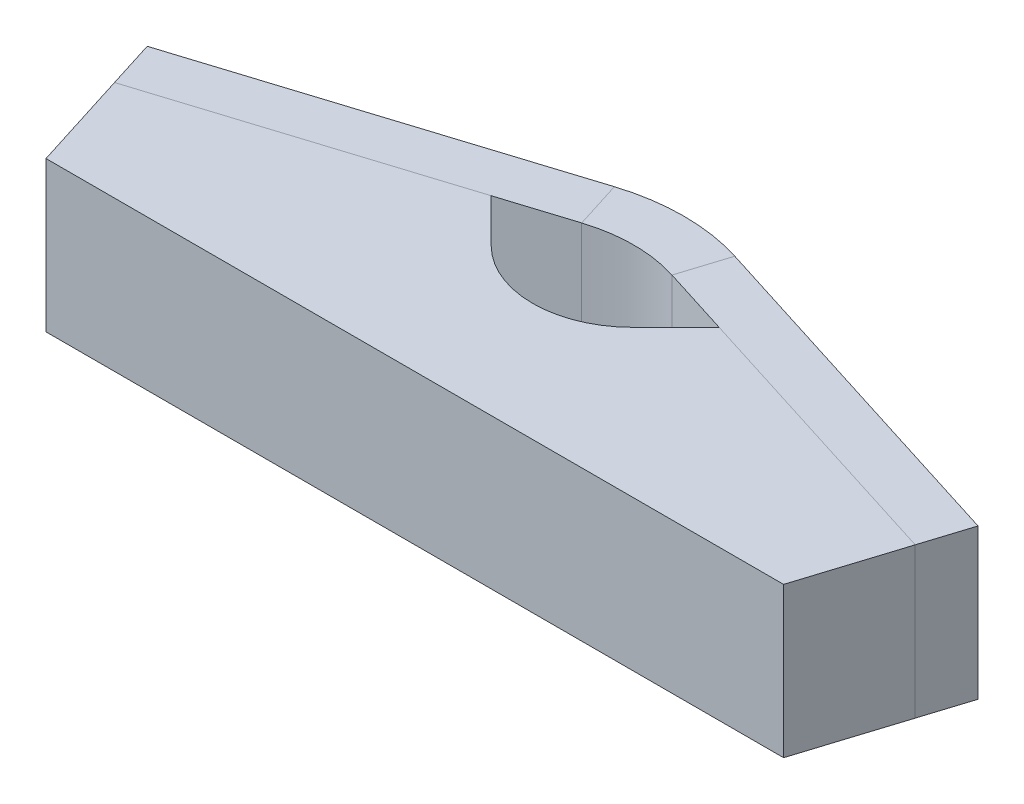
ISO-10303-21;
HEADER;
FILE_DESCRIPTION(('STEP AP214'),'2;1');
FILE_NAME('part.step','',(''),(''),'','','');
FILE_SCHEMA(('AUTOMOTIVE_DESIGN { 1 0 10303 214 1 1 1 1 }'));
ENDSEC;
DATA;
#1=APPLICATION_CONTEXT('core data for automotive mechanical design processes');
#2=APPLICATION_PROTOCOL_DEFINITION('international standard','automotive_design',2000,#1);
#3=PRODUCT_CONTEXT('',#1,'mechanical');
#4=PRODUCT('Part','Part','',(#3));
#5=PRODUCT_RELATED_PRODUCT_CATEGORY('part','',(#4));
#6=PRODUCT_DEFINITION_FORMATION('','',#4);
#7=PRODUCT_DEFINITION_CONTEXT('part definition',#1,'design');
#8=PRODUCT_DEFINITION('design','',#6,#7);
#9=PRODUCT_DEFINITION_SHAPE('','',#8);
#10=(LENGTH_UNIT() NAMED_UNIT(*) SI_UNIT(.MILLI.,.METRE.));
#11=(NAMED_UNIT(*) PLANE_ANGLE_UNIT() SI_UNIT($,.RADIAN.));
#12=(NAMED_UNIT(*) SI_UNIT($,.STERADIAN.) SOLID_ANGLE_UNIT());
#13=UNCERTAINTY_MEASURE_WITH_UNIT(LENGTH_MEASURE(1.E-05),#10,'distance_accuracy_value','');
#14=(GEOMETRIC_REPRESENTATION_CONTEXT(3) GLOBAL_UNCERTAINTY_ASSIGNED_CONTEXT((#13)) GLOBAL_UNIT_ASSIGNED_CONTEXT((#10,
#11,#12)) REPRESENTATION_CONTEXT('',''));
#15=CARTESIAN_POINT('',(0.,0.,0.));
#16=DIRECTION('',(0.,0.,1.));
#17=DIRECTION('',(1.,0.,0.));
#18=AXIS2_PLACEMENT_3D('',#15,#16,#17);
#19=CARTESIAN_POINT('',(25.4,-4.7625,8.0085892375262));
#20=DIRECTION('',(0.,1.,0.));
#21=DIRECTION('',(0.953716950748227,0.,0.300705799504274));
#22=AXIS2_PLACEMENT_3D('',#19,#20,#21);
#23=PLANE('',#22);
#24=DIRECTION('',(-0.300705799504274,0.,0.953716950748227));
#25=VECTOR('',#24,1.);
#26=CARTESIAN_POINT('',(2.8642227402782,-4.7625,0.903085961089362));
#27=LINE('',#26,#25);
#28=CARTESIAN_POINT('',(3.81896365370427,-4.7625,-2.12496535753626));
#29=VERTEX_POINT('',#28);
#30=CARTESIAN_POINT('',(2.8642227402782,-4.7625,0.903085961089362));
#31=VERTEX_POINT('',#30);
#32=EDGE_CURVE('E12',#29,#31,#27,.T.);
#33=ORIENTED_EDGE('',*,*,#32,.F.);
#34=DIRECTION('',(-0.953716950748227,0.,-0.300705799504274));
#35=VECTOR('',#34,1.);
#36=CARTESIAN_POINT('',(26.3547409134261,-4.7625,4.98053791890058));
#37=LINE('',#36,#35);
#38=CARTESIAN_POINT('',(26.3547409134261,-4.7625,4.98053791890058));
#39=VERTEX_POINT('',#38);
#40=EDGE_CURVE('E99',#29,#39,#37,.F.);
#41=ORIENTED_EDGE('',*,*,#40,.T.);
#42=DIRECTION('',(-0.300705799504274,0.,0.953716950748227));
#43=VECTOR('',#42,1.);
#44=CARTESIAN_POINT('',(25.4,-4.7625,8.0085892375262));
#45=LINE('',#44,#43);
#46=CARTESIAN_POINT('',(25.4,-4.7625,8.0085892375262));
#47=VERTEX_POINT('',#46);
#48=EDGE_CURVE('E59',#39,#47,#45,.T.);
#49=ORIENTED_EDGE('',*,*,#48,.T.);
#50=DIRECTION('',(0.953716950748227,0.,0.300705799504274));
#51=VECTOR('',#50,1.);
#52=CARTESIAN_POINT('',(25.4,-4.7625,8.0085892375262));
#53=LINE('',#52,#51);
#54=EDGE_CURVE('E102',#31,#47,#53,.T.);
#55=ORIENTED_EDGE('',*,*,#54,.F.);
#56=EDGE_LOOP('',(#33,#41,#49,#55));
#57=FACE_BOUND('',#56,.T.);
#58=ADVANCED_FACE('F49',(#57),#23,.F.);
#59=CARTESIAN_POINT('',(25.4,4.7625,8.0085892375262));
#60=DIRECTION('',(0.953716950748227,0.,0.300705799504274));
#61=DIRECTION('',(0.,-1.,0.));
#62=AXIS2_PLACEMENT_3D('',#59,#60,#61);
#63=PLANE('',#62);
#64=ORIENTED_EDGE('',*,*,#48,.F.);
#65=DIRECTION('',(0.,1.,0.));
#66=VECTOR('',#65,1.);
#67=CARTESIAN_POINT('',(26.3547409134261,4.7625,4.98053791890058));
#68=LINE('',#67,#66);
#69=CARTESIAN_POINT('',(26.3547409134261,4.7625,4.98053791890058));
#70=VERTEX_POINT('',#69);
#71=EDGE_CURVE('E127',#70,#39,#68,.F.);
#72=ORIENTED_EDGE('',*,*,#71,.F.);
#73=DIRECTION('',(-0.300705799504274,0.,0.953716950748227));
#74=VECTOR('',#73,1.);
#75=CARTESIAN_POINT('',(25.4,4.7625,8.0085892375262));
#76=LINE('',#75,#74);
#77=CARTESIAN_POINT('',(25.4,4.7625,8.0085892375262));
#78=VERTEX_POINT('',#77);
#79=EDGE_CURVE('E145',#70,#78,#76,.T.);
#80=ORIENTED_EDGE('',*,*,#79,.T.);
#81=DIRECTION('',(0.,-1.,0.));
#82=VECTOR('',#81,1.);
#83=CARTESIAN_POINT('',(25.4,4.7625,8.0085892375262));
#84=LINE('',#83,#82);
#85=EDGE_CURVE('E156',#78,#47,#84,.T.);
#86=ORIENTED_EDGE('',*,*,#85,.T.);
#87=EDGE_LOOP('',(#64,#72,#80,#86));
#88=FACE_BOUND('',#87,.T.);
#89=ADVANCED_FACE('F162',(#88),#63,.T.);
#90=CARTESIAN_POINT('',(25.4,4.7625,8.0085892375262));
#91=DIRECTION('',(0.,1.,0.));
#92=DIRECTION('',(0.953716950748227,0.,0.300705799504274));
#93=AXIS2_PLACEMENT_3D('',#90,#91,#92);
#94=PLANE('',#93);
#95=ORIENTED_EDGE('',*,*,#79,.F.);
#96=DIRECTION('',(-0.953716950748227,0.,-0.300705799504274));
#97=VECTOR('',#96,1.);
#98=CARTESIAN_POINT('',(26.3547409134261,4.7625,4.98053791890058));
#99=LINE('',#98,#97);
#100=CARTESIAN_POINT('',(3.81896365370427,4.7625,-2.12496535753626));
#101=VERTEX_POINT('',#100);
#102=EDGE_CURVE('E187',#101,#70,#99,.F.);
#103=ORIENTED_EDGE('',*,*,#102,.F.);
#104=DIRECTION('',(-0.300705799504274,0.,0.953716950748227));
#105=VECTOR('',#104,1.);
#106=CARTESIAN_POINT('',(2.8642227402782,4.7625,0.903085961089362));
#107=LINE('',#106,#105);
#108=CARTESIAN_POINT('',(2.8642227402782,4.7625,0.903085961089362));
#109=VERTEX_POINT('',#108);
#110=EDGE_CURVE('E142',#101,#109,#107,.T.);
#111=ORIENTED_EDGE('',*,*,#110,.T.);
#112=DIRECTION('',(0.953716950748227,0.,0.300705799504274));
#113=VECTOR('',#112,1.);
#114=CARTESIAN_POINT('',(25.4,4.7625,8.0085892375262));
#115=LINE('',#114,#113);
#116=EDGE_CURVE('E163',#109,#78,#115,.T.);
#117=ORIENTED_EDGE('',*,*,#116,.T.);
#118=EDGE_LOOP('',(#95,#103,#111,#117));
#119=FACE_BOUND('',#118,.T.);
#120=ADVANCED_FACE('F193',(#119),#94,.T.);
#121=CARTESIAN_POINT('',(0.,4.7625,9.98723991696622));
#122=DIRECTION('',(0.,1.,0.));
#123=DIRECTION('',(0.,0.,1.));
#124=AXIS2_PLACEMENT_3D('',#121,#122,#123);
#125=PLANE('',#124);
#126=ORIENTED_EDGE('',*,*,#110,.F.);
#127=CARTESIAN_POINT('',(0.,4.7625,9.98723991696622));
#128=DIRECTION('',(0.,1.,0.));
#129=DIRECTION('',(0.,0.,1.));
#130=AXIS2_PLACEMENT_3D('',#127,#128,#129);
#131=CIRCLE('',#130,12.7);
#132=CARTESIAN_POINT('',(-3.81896365370428,4.7625,-2.12496535753626));
#133=VERTEX_POINT('',#132);
#134=EDGE_CURVE('E117',#101,#133,#131,.T.);
#135=ORIENTED_EDGE('',*,*,#134,.T.);
#136=DIRECTION('',(0.300705799504274,0.,0.953716950748227));
#137=VECTOR('',#136,1.);
#138=CARTESIAN_POINT('',(-2.86422274027821,4.7625,0.903085961089365));
#139=LINE('',#138,#137);
#140=CARTESIAN_POINT('',(-2.86422274027821,4.7625,0.903085961089365));
#141=VERTEX_POINT('',#140);
#142=EDGE_CURVE('E67',#133,#141,#139,.T.);
#143=ORIENTED_EDGE('',*,*,#142,.T.);
#144=CARTESIAN_POINT('',(0.,4.7625,9.98723991696622));
#145=DIRECTION('',(0.,-1.,0.));
#146=DIRECTION('',(0.,0.,-1.));
#147=AXIS2_PLACEMENT_3D('',#144,#145,#146);
#148=CIRCLE('',#147,9.525);
#149=EDGE_CURVE('E160',#109,#141,#148,.F.);
#150=ORIENTED_EDGE('',*,*,#149,.F.);
#151=EDGE_LOOP('',(#126,#135,#143,#150));
#152=FACE_BOUND('',#151,.T.);
#153=ADVANCED_FACE('F196',(#152),#125,.T.);
#154=CARTESIAN_POINT('',(0.,4.7625,0.));
#155=DIRECTION('',(0.,1.,0.));
#156=DIRECTION('',(0.953716950748227,0.,-0.300705799504274));
#157=AXIS2_PLACEMENT_3D('',#154,#155,#156);
#158=PLANE('',#157);
#159=ORIENTED_EDGE('',*,*,#142,.F.);
#160=DIRECTION('',(-0.953716950748227,0.,0.300705799504274));
#161=VECTOR('',#160,1.);
#162=CARTESIAN_POINT('',(-0.954740913426069,4.7625,-3.02805131862562));
#163=LINE('',#162,#161);
#164=CARTESIAN_POINT('',(-26.3547409134261,4.7625,4.98053791890058));
#165=VERTEX_POINT('',#164);
#166=EDGE_CURVE('E186',#165,#133,#163,.F.);
#167=ORIENTED_EDGE('',*,*,#166,.F.);
#168=DIRECTION('',(0.300705799504274,0.,0.953716950748227));
#169=VECTOR('',#168,1.);
#170=CARTESIAN_POINT('',(-25.4,4.7625,8.0085892375262));
#171=LINE('',#170,#169);
#172=CARTESIAN_POINT('',(-25.4,4.7625,8.0085892375262));
#173=VERTEX_POINT('',#172);
#174=EDGE_CURVE('E138',#165,#173,#171,.T.);
#175=ORIENTED_EDGE('',*,*,#174,.T.);
#176=DIRECTION('',(0.953716950748227,0.,-0.300705799504274));
#177=VECTOR('',#176,1.);
#178=CARTESIAN_POINT('',(0.,4.7625,0.));
#179=LINE('',#178,#177);
#180=EDGE_CURVE('E170',#173,#141,#179,.T.);
#181=ORIENTED_EDGE('',*,*,#180,.T.);
#182=EDGE_LOOP('',(#159,#167,#175,#181));
#183=FACE_BOUND('',#182,.T.);
#184=ADVANCED_FACE('F207',(#183),#158,.T.);
#185=CARTESIAN_POINT('',(-25.4,4.7625,8.0085892375262));
#186=DIRECTION('',(0.953716950748227,0.,-0.300705799504274));
#187=DIRECTION('',(0.,-1.,0.));
#188=AXIS2_PLACEMENT_3D('',#185,#186,#187);
#189=PLANE('',#188);
#190=ORIENTED_EDGE('',*,*,#174,.F.);
#191=DIRECTION('',(0.,1.,0.));
#192=VECTOR('',#191,1.);
#193=CARTESIAN_POINT('',(-26.3547409134261,4.7625,4.98053791890058));
#194=LINE('',#193,#192);
#195=CARTESIAN_POINT('',(-26.3547409134261,-4.7625,4.98053791890058));
#196=VERTEX_POINT('',#195);
#197=EDGE_CURVE('E122',#165,#196,#194,.F.);
#198=ORIENTED_EDGE('',*,*,#197,.T.);
#199=DIRECTION('',(0.300705799504274,0.,0.953716950748227));
#200=VECTOR('',#199,1.);
#201=CARTESIAN_POINT('',(-25.4,-4.7625,8.0085892375262));
#202=LINE('',#201,#200);
#203=CARTESIAN_POINT('',(-25.4,-4.7625,8.0085892375262));
#204=VERTEX_POINT('',#203);
#205=EDGE_CURVE('E135',#196,#204,#202,.T.);
#206=ORIENTED_EDGE('',*,*,#205,.T.);
#207=DIRECTION('',(0.,-1.,0.));
#208=VECTOR('',#207,1.);
#209=CARTESIAN_POINT('',(-25.4,4.7625,8.0085892375262));
#210=LINE('',#209,#208);
#211=EDGE_CURVE('E173',#173,#204,#210,.T.);
#212=ORIENTED_EDGE('',*,*,#211,.F.);
#213=EDGE_LOOP('',(#190,#198,#206,#212));
#214=FACE_BOUND('',#213,.T.);
#215=ADVANCED_FACE('F213',(#214),#189,.F.);
#216=CARTESIAN_POINT('',(0.,-4.7625,0.));
#217=DIRECTION('',(0.,1.,0.));
#218=DIRECTION('',(0.953716950748227,0.,-0.300705799504274));
#219=AXIS2_PLACEMENT_3D('',#216,#217,#218);
#220=PLANE('',#219);
#221=ORIENTED_EDGE('',*,*,#205,.F.);
#222=DIRECTION('',(-0.953716950748227,0.,0.300705799504274));
#223=VECTOR('',#222,1.);
#224=CARTESIAN_POINT('',(-0.954740913426069,-4.7625,-3.02805131862562));
#225=LINE('',#224,#223);
#226=CARTESIAN_POINT('',(-3.81896365370428,-4.7625,-2.12496535753625));
#227=VERTEX_POINT('',#226);
#228=EDGE_CURVE('E184',#196,#227,#225,.F.);
#229=ORIENTED_EDGE('',*,*,#228,.T.);
#230=DIRECTION('',(0.300705799504274,0.,0.953716950748227));
#231=VECTOR('',#230,1.);
#232=CARTESIAN_POINT('',(-2.86422274027821,-4.7625,0.903085961089365));
#233=LINE('',#232,#231);
#234=CARTESIAN_POINT('',(-2.86422274027821,-4.7625,0.903085961089365));
#235=VERTEX_POINT('',#234);
#236=EDGE_CURVE('E53',#227,#235,#233,.T.);
#237=ORIENTED_EDGE('',*,*,#236,.T.);
#238=DIRECTION('',(0.953716950748227,0.,-0.300705799504274));
#239=VECTOR('',#238,1.);
#240=CARTESIAN_POINT('',(0.,-4.7625,0.));
#241=LINE('',#240,#239);
#242=EDGE_CURVE('E165',#204,#235,#241,.T.);
#243=ORIENTED_EDGE('',*,*,#242,.F.);
#244=EDGE_LOOP('',(#221,#229,#237,#243));
#245=FACE_BOUND('',#244,.T.);
#246=ADVANCED_FACE('F217',(#245),#220,.F.);
#247=CARTESIAN_POINT('',(0.,-4.7625,9.98723991696622));
#248=DIRECTION('',(0.,-1.,0.));
#249=DIRECTION('',(0.,0.,-1.));
#250=AXIS2_PLACEMENT_3D('',#247,#248,#249);
#251=PLANE('',#250);
#252=CARTESIAN_POINT('',(0.,-4.7625,9.98723991696622));
#253=DIRECTION('',(0.,1.,0.));
#254=DIRECTION('',(0.,0.,1.));
#255=AXIS2_PLACEMENT_3D('',#252,#253,#254);
#256=CIRCLE('',#255,12.7);
#257=EDGE_CURVE('E115',#227,#29,#256,.F.);
#258=ORIENTED_EDGE('',*,*,#257,.T.);
#259=ORIENTED_EDGE('',*,*,#32,.T.);
#260=CARTESIAN_POINT('',(0.,-4.7625,9.98723991696622));
#261=DIRECTION('',(0.,1.,0.));
#262=DIRECTION('',(0.,0.,1.));
#263=AXIS2_PLACEMENT_3D('',#260,#261,#262);
#264=CIRCLE('',#263,9.525);
#265=EDGE_CURVE('E180',#235,#31,#264,.F.);
#266=ORIENTED_EDGE('',*,*,#265,.F.);
#267=ORIENTED_EDGE('',*,*,#236,.F.);
#268=EDGE_LOOP('',(#258,#259,#266,#267));
#269=FACE_BOUND('',#268,.T.);
#270=ADVANCED_FACE('F51',(#269),#251,.T.);
#271=CARTESIAN_POINT('',(0.,4.7625,0.));
#272=DIRECTION('',(-0.300705799504274,0.,-0.953716950748227));
#273=DIRECTION('',(-0.953716950748227,0.,0.300705799504274));
#274=AXIS2_PLACEMENT_3D('',#271,#272,#273);
#275=PLANE('',#274);
#276=ORIENTED_EDGE('',*,*,#242,.T.);
#277=DIRECTION('',(0.,-1.,0.));
#278=VECTOR('',#277,1.);
#279=CARTESIAN_POINT('',(-2.86422274027821,4.7625,0.903085961089367));
#280=LINE('',#279,#278);
#281=EDGE_CURVE('E177',#235,#141,#280,.F.);
#282=ORIENTED_EDGE('',*,*,#281,.T.);
#283=ORIENTED_EDGE('',*,*,#180,.F.);
#284=ORIENTED_EDGE('',*,*,#211,.T.);
#285=EDGE_LOOP('',(#276,#282,#283,#284));
#286=FACE_BOUND('',#285,.T.);
#287=ADVANCED_FACE('F212',(#286),#275,.F.);
#288=CARTESIAN_POINT('',(25.4,4.7625,8.0085892375262));
#289=DIRECTION('',(0.300705799504274,0.,-0.953716950748227));
#290=DIRECTION('',(-0.953716950748227,0.,-0.300705799504274));
#291=AXIS2_PLACEMENT_3D('',#288,#289,#290);
#292=PLANE('',#291);
#293=ORIENTED_EDGE('',*,*,#116,.F.);
#294=DIRECTION('',(0.,-1.,0.));
#295=VECTOR('',#294,1.);
#296=CARTESIAN_POINT('',(2.8642227402782,-4.7625,0.903085961089364));
#297=LINE('',#296,#295);
#298=EDGE_CURVE('E159',#109,#31,#297,.T.);
#299=ORIENTED_EDGE('',*,*,#298,.T.);
#300=ORIENTED_EDGE('',*,*,#54,.T.);
#301=ORIENTED_EDGE('',*,*,#85,.F.);
#302=EDGE_LOOP('',(#293,#299,#300,#301));
#303=FACE_BOUND('',#302,.T.);
#304=ADVANCED_FACE('F155',(#303),#292,.F.);
#305=CARTESIAN_POINT('',(0.,4.7625,9.98723991696622));
#306=DIRECTION('',(0.,1.,0.));
#307=DIRECTION('',(0.,0.,1.));
#308=AXIS2_PLACEMENT_3D('',#305,#306,#307);
#309=CYLINDRICAL_SURFACE('',#308,9.525);
#310=ORIENTED_EDGE('',*,*,#149,.T.);
#311=ORIENTED_EDGE('',*,*,#281,.F.);
#312=ORIENTED_EDGE('',*,*,#265,.T.);
#313=ORIENTED_EDGE('',*,*,#298,.F.);
#314=EDGE_LOOP('',(#310,#311,#312,#313));
#315=FACE_BOUND('',#314,.T.);
#316=ADVANCED_FACE('F199',(#315),#309,.F.);
#317=CARTESIAN_POINT('',(-0.954740913426069,4.7625,-3.02805131862562));
#318=DIRECTION('',(-0.300705799504274,0.,-0.953716950748227));
#319=DIRECTION('',(-0.953716950748227,0.,0.300705799504274));
#320=AXIS2_PLACEMENT_3D('',#317,#318,#319);
#321=PLANE('',#320);
#322=ORIENTED_EDGE('',*,*,#228,.F.);
#323=ORIENTED_EDGE('',*,*,#197,.F.);
#324=ORIENTED_EDGE('',*,*,#166,.T.);
#325=DIRECTION('',(0.,1.,0.));
#326=VECTOR('',#325,1.);
#327=CARTESIAN_POINT('',(-3.81896365370428,4.7625,-2.12496535753625));
#328=LINE('',#327,#326);
#329=EDGE_CURVE('E121',#227,#133,#328,.T.);
#330=ORIENTED_EDGE('',*,*,#329,.F.);
#331=EDGE_LOOP('',(#322,#323,#324,#330));
#332=FACE_BOUND('',#331,.T.);
#333=ADVANCED_FACE('F219',(#332),#321,.T.);
#334=CARTESIAN_POINT('',(26.3547409134261,4.7625,4.98053791890058));
#335=DIRECTION('',(0.300705799504274,0.,-0.953716950748227));
#336=DIRECTION('',(-0.953716950748227,0.,-0.300705799504274));
#337=AXIS2_PLACEMENT_3D('',#334,#335,#336);
#338=PLANE('',#337);
#339=ORIENTED_EDGE('',*,*,#102,.T.);
#340=ORIENTED_EDGE('',*,*,#71,.T.);
#341=ORIENTED_EDGE('',*,*,#40,.F.);
#342=DIRECTION('',(0.,1.,0.));
#343=VECTOR('',#342,1.);
#344=CARTESIAN_POINT('',(3.81896365370427,4.7625,-2.12496535753626));
#345=LINE('',#344,#343);
#346=EDGE_CURVE('E112',#101,#29,#345,.F.);
#347=ORIENTED_EDGE('',*,*,#346,.F.);
#348=EDGE_LOOP('',(#339,#340,#341,#347));
#349=FACE_BOUND('',#348,.T.);
#350=ADVANCED_FACE('F125',(#349),#338,.T.);
#351=CARTESIAN_POINT('',(0.,4.7625,9.98723991696622));
#352=DIRECTION('',(0.,1.,0.));
#353=DIRECTION('',(0.,0.,1.));
#354=AXIS2_PLACEMENT_3D('',#351,#352,#353);
#355=CYLINDRICAL_SURFACE('',#354,12.7);
#356=ORIENTED_EDGE('',*,*,#134,.F.);
#357=ORIENTED_EDGE('',*,*,#346,.T.);
#358=ORIENTED_EDGE('',*,*,#257,.F.);
#359=ORIENTED_EDGE('',*,*,#329,.T.);
#360=EDGE_LOOP('',(#356,#357,#358,#359));
#361=FACE_BOUND('',#360,.T.);
#362=ADVANCED_FACE('F113',(#361),#355,.T.);
#363=CLOSED_SHELL('',(#58,#89,#120,#153,#184,#215,#246,#270,#287,#304,#316,#333,#350,#362));
#364=MANIFOLD_SOLID_BREP('B2',#363);
#365=CARTESIAN_POINT('',(0.,-4.7625,0.));
#366=DIRECTION('',(0.,-1.,0.));
#367=DIRECTION('',(0.,0.,-1.));
#368=AXIS2_PLACEMENT_3D('',#365,#366,#367);
#369=PLANE('',#368);
#370=DIRECTION('',(0.300705799504274,0.,0.953716950748227));
#371=VECTOR('',#370,1.);
#372=CARTESIAN_POINT('',(-23.3978526906184,-4.7625,14.3585892375262));
#373=LINE('',#372,#371);
#374=CARTESIAN_POINT('',(-25.4,-4.7625,8.0085892375262));
#375=VERTEX_POINT('',#374);
#376=CARTESIAN_POINT('',(-23.3978526906184,-4.7625,14.3585892375262));
#377=VERTEX_POINT('',#376);
#378=EDGE_CURVE('E487',#375,#377,#373,.T.);
#379=ORIENTED_EDGE('',*,*,#378,.F.);
#380=DIRECTION('',(-0.953716950748227,0.,0.300705799504274));
#381=VECTOR('',#380,1.);
#382=CARTESIAN_POINT('',(-25.4,-4.7625,8.0085892375262));
#383=LINE('',#382,#381);
#384=CARTESIAN_POINT('',(-7.23169208824628,-4.7625,2.28014375696978));
#385=VERTEX_POINT('',#384);
#386=EDGE_CURVE('E490',#385,#375,#383,.T.);
#387=ORIENTED_EDGE('',*,*,#386,.F.);
#388=DIRECTION('',(-0.707106781186548,0.,-0.707106781186548));
#389=VECTOR('',#388,1.);
#390=CARTESIAN_POINT('',(-7.23169208824628,-4.7625,2.28014375696978));
#391=LINE('',#390,#389);
#392=CARTESIAN_POINT('',(-4.49012806053458,-4.7625,5.02170778468149));
#393=VERTEX_POINT('',#392);
#394=EDGE_CURVE('E494',#393,#385,#391,.T.);
#395=ORIENTED_EDGE('',*,*,#394,.F.);
#396=CARTESIAN_POINT('',(0.,-4.7625,0.531579724146914));
#397=DIRECTION('',(0.,-1.,0.));
#398=DIRECTION('',(0.,0.,-1.));
#399=AXIS2_PLACEMENT_3D('',#396,#397,#398);
#400=CIRCLE('',#399,6.35);
#401=CARTESIAN_POINT('',(4.49012806053458,-4.7625,5.02170778468149));
#402=VERTEX_POINT('',#401);
#403=EDGE_CURVE('E47',#393,#402,#400,.F.);
#404=ORIENTED_EDGE('',*,*,#403,.T.);
#405=DIRECTION('',(-0.707106781186548,0.,0.707106781186547));
#406=VECTOR('',#405,1.);
#407=CARTESIAN_POINT('',(0.,-4.7625,9.51183584521607));
#408=LINE('',#407,#406);
#409=CARTESIAN_POINT('',(7.23169208824628,-4.7625,2.28014375696979));
#410=VERTEX_POINT('',#409);
#411=EDGE_CURVE('E496',#410,#402,#408,.T.);
#412=ORIENTED_EDGE('',*,*,#411,.F.);
#413=DIRECTION('',(-0.953716950748227,0.,-0.300705799504274));
#414=VECTOR('',#413,1.);
#415=CARTESIAN_POINT('',(7.23169208824628,-4.7625,2.28014375696979));
#416=LINE('',#415,#414);
#417=CARTESIAN_POINT('',(25.4,-4.7625,8.0085892375262));
#418=VERTEX_POINT('',#417);
#419=EDGE_CURVE('E461',#418,#410,#416,.T.);
#420=ORIENTED_EDGE('',*,*,#419,.F.);
#421=DIRECTION('',(0.300705799504274,0.,-0.953716950748227));
#422=VECTOR('',#421,1.);
#423=CARTESIAN_POINT('',(25.4,-4.7625,8.0085892375262));
#424=LINE('',#423,#422);
#425=CARTESIAN_POINT('',(23.3978526906184,-4.7625,14.3585892375262));
#426=VERTEX_POINT('',#425);
#427=EDGE_CURVE('E455',#426,#418,#424,.T.);
#428=ORIENTED_EDGE('',*,*,#427,.F.);
#429=DIRECTION('',(1.,0.,0.));
#430=VECTOR('',#429,1.);
#431=CARTESIAN_POINT('',(23.3978526906184,-4.7625,14.3585892375262));
#432=LINE('',#431,#430);
#433=EDGE_CURVE('E458',#377,#426,#432,.T.);
#434=ORIENTED_EDGE('',*,*,#433,.F.);
#435=EDGE_LOOP('',(#379,#387,#395,#404,#412,#420,#428,#434));
#436=FACE_BOUND('',#435,.T.);
#437=ADVANCED_FACE('F393',(#436),#369,.T.);
#438=CARTESIAN_POINT('',(0.,4.7625,0.));
#439=DIRECTION('',(0.,-1.,0.));
#440=DIRECTION('',(0.,0.,-1.));
#441=AXIS2_PLACEMENT_3D('',#438,#439,#440);
#442=PLANE('',#441);
#443=DIRECTION('',(0.300705799504274,0.,0.953716950748227));
#444=VECTOR('',#443,1.);
#445=CARTESIAN_POINT('',(-23.3978526906184,4.7625,14.3585892375262));
#446=LINE('',#445,#444);
#447=CARTESIAN_POINT('',(-25.4,4.7625,8.0085892375262));
#448=VERTEX_POINT('',#447);
#449=CARTESIAN_POINT('',(-23.3978526906184,4.7625,14.3585892375262));
#450=VERTEX_POINT('',#449);
#451=EDGE_CURVE('E485',#448,#450,#446,.T.);
#452=ORIENTED_EDGE('',*,*,#451,.T.);
#453=DIRECTION('',(1.,0.,0.));
#454=VECTOR('',#453,1.);
#455=CARTESIAN_POINT('',(23.3978526906184,4.7625,14.3585892375262));
#456=LINE('',#455,#454);
#457=CARTESIAN_POINT('',(23.3978526906184,4.7625,14.3585892375262));
#458=VERTEX_POINT('',#457);
#459=EDGE_CURVE('E527',#450,#458,#456,.T.);
#460=ORIENTED_EDGE('',*,*,#459,.T.);
#461=DIRECTION('',(0.300705799504274,0.,-0.953716950748227));
#462=VECTOR('',#461,1.);
#463=CARTESIAN_POINT('',(25.4,4.7625,8.0085892375262));
#464=LINE('',#463,#462);
#465=CARTESIAN_POINT('',(25.4,4.7625,8.0085892375262));
#466=VERTEX_POINT('',#465);
#467=EDGE_CURVE('E470',#458,#466,#464,.T.);
#468=ORIENTED_EDGE('',*,*,#467,.T.);
#469=DIRECTION('',(-0.953716950748227,0.,-0.300705799504274));
#470=VECTOR('',#469,1.);
#471=CARTESIAN_POINT('',(7.23169208824628,4.7625,2.28014375696979));
#472=LINE('',#471,#470);
#473=CARTESIAN_POINT('',(7.23169208824628,4.7625,2.28014375696979));
#474=VERTEX_POINT('',#473);
#475=EDGE_CURVE('E522',#466,#474,#472,.T.);
#476=ORIENTED_EDGE('',*,*,#475,.T.);
#477=DIRECTION('',(-0.707106781186548,0.,0.707106781186547));
#478=VECTOR('',#477,1.);
#479=CARTESIAN_POINT('',(0.,4.7625,9.51183584521607));
#480=LINE('',#479,#478);
#481=CARTESIAN_POINT('',(4.49012806053458,4.7625,5.02170778468149));
#482=VERTEX_POINT('',#481);
#483=EDGE_CURVE('E515',#474,#482,#480,.T.);
#484=ORIENTED_EDGE('',*,*,#483,.T.);
#485=CARTESIAN_POINT('',(0.,4.7625,0.531579724146914));
#486=DIRECTION('',(0.,-1.,0.));
#487=DIRECTION('',(0.,0.,-1.));
#488=AXIS2_PLACEMENT_3D('',#485,#486,#487);
#489=CIRCLE('',#488,6.35);
#490=CARTESIAN_POINT('',(-4.49012806053458,4.7625,5.02170778468149));
#491=VERTEX_POINT('',#490);
#492=EDGE_CURVE('E401',#482,#491,#489,.T.);
#493=ORIENTED_EDGE('',*,*,#492,.T.);
#494=DIRECTION('',(-0.707106781186548,0.,-0.707106781186548));
#495=VECTOR('',#494,1.);
#496=CARTESIAN_POINT('',(-7.23169208824628,4.7625,2.28014375696978));
#497=LINE('',#496,#495);
#498=CARTESIAN_POINT('',(-7.23169208824628,4.7625,2.28014375696978));
#499=VERTEX_POINT('',#498);
#500=EDGE_CURVE('E481',#491,#499,#497,.T.);
#501=ORIENTED_EDGE('',*,*,#500,.T.);
#502=DIRECTION('',(-0.953716950748227,0.,0.300705799504274));
#503=VECTOR('',#502,1.);
#504=CARTESIAN_POINT('',(-25.4,4.7625,8.0085892375262));
#505=LINE('',#504,#503);
#506=EDGE_CURVE('E478',#499,#448,#505,.T.);
#507=ORIENTED_EDGE('',*,*,#506,.T.);
#508=EDGE_LOOP('',(#452,#460,#468,#476,#484,#493,#501,#507));
#509=FACE_BOUND('',#508,.T.);
#510=ADVANCED_FACE('F520',(#509),#442,.F.);
#511=CARTESIAN_POINT('',(23.3978526906184,-56.9786741726333,14.3585892375262));
#512=DIRECTION('',(0.,0.,1.));
#513=DIRECTION('',(1.,0.,0.));
#514=AXIS2_PLACEMENT_3D('',#511,#512,#513);
#515=PLANE('',#514);
#516=DIRECTION('',(0.,1.,0.));
#517=VECTOR('',#516,1.);
#518=CARTESIAN_POINT('',(-23.3978526906184,-56.9786741726333,14.3585892375262));
#519=LINE('',#518,#517);
#520=EDGE_CURVE('E477',#377,#450,#519,.T.);
#521=ORIENTED_EDGE('',*,*,#520,.F.);
#522=ORIENTED_EDGE('',*,*,#433,.T.);
#523=DIRECTION('',(0.,1.,0.));
#524=VECTOR('',#523,1.);
#525=CARTESIAN_POINT('',(23.3978526906184,-56.9786741726333,14.3585892375262));
#526=LINE('',#525,#524);
#527=EDGE_CURVE('E465',#426,#458,#526,.T.);
#528=ORIENTED_EDGE('',*,*,#527,.T.);
#529=ORIENTED_EDGE('',*,*,#459,.F.);
#530=EDGE_LOOP('',(#521,#522,#528,#529));
#531=FACE_BOUND('',#530,.T.);
#532=ADVANCED_FACE('F476',(#531),#515,.T.);
#533=CARTESIAN_POINT('',(25.4,-56.9786741726333,8.0085892375262));
#534=DIRECTION('',(0.953716950748227,0.,0.300705799504274));
#535=DIRECTION('',(0.300705799504274,0.,-0.953716950748227));
#536=AXIS2_PLACEMENT_3D('',#533,#534,#535);
#537=PLANE('',#536);
#538=ORIENTED_EDGE('',*,*,#527,.F.);
#539=ORIENTED_EDGE('',*,*,#427,.T.);
#540=DIRECTION('',(0.,1.,0.));
#541=VECTOR('',#540,1.);
#542=CARTESIAN_POINT('',(25.4,-56.9786741726333,8.0085892375262));
#543=LINE('',#542,#541);
#544=EDGE_CURVE('E464',#418,#466,#543,.T.);
#545=ORIENTED_EDGE('',*,*,#544,.T.);
#546=ORIENTED_EDGE('',*,*,#467,.F.);
#547=EDGE_LOOP('',(#538,#539,#545,#546));
#548=FACE_BOUND('',#547,.T.);
#549=ADVANCED_FACE('F468',(#548),#537,.T.);
#550=CARTESIAN_POINT('',(7.23169208824628,-56.9786741726333,2.28014375696979));
#551=DIRECTION('',(0.300705799504274,0.,-0.953716950748227));
#552=DIRECTION('',(-0.953716950748227,0.,-0.300705799504274));
#553=AXIS2_PLACEMENT_3D('',#550,#551,#552);
#554=PLANE('',#553);
#555=ORIENTED_EDGE('',*,*,#544,.F.);
#556=ORIENTED_EDGE('',*,*,#419,.T.);
#557=DIRECTION('',(0.,1.,0.));
#558=VECTOR('',#557,1.);
#559=CARTESIAN_POINT('',(7.23169208824628,-56.9786741726333,2.28014375696979));
#560=LINE('',#559,#558);
#561=EDGE_CURVE('E499',#410,#474,#560,.T.);
#562=ORIENTED_EDGE('',*,*,#561,.T.);
#563=ORIENTED_EDGE('',*,*,#475,.F.);
#564=EDGE_LOOP('',(#555,#556,#562,#563));
#565=FACE_BOUND('',#564,.T.);
#566=ADVANCED_FACE('F539',(#565),#554,.T.);
#567=CARTESIAN_POINT('',(0.,-56.9786741726333,9.51183584521607));
#568=DIRECTION('',(-0.707106781186547,0.,-0.707106781186548));
#569=DIRECTION('',(-0.707106781186548,0.,0.707106781186547));
#570=AXIS2_PLACEMENT_3D('',#567,#568,#569);
#571=PLANE('',#570);
#572=ORIENTED_EDGE('',*,*,#411,.T.);
#573=DIRECTION('',(0.,1.,0.));
#574=VECTOR('',#573,1.);
#575=CARTESIAN_POINT('',(4.49012806053458,4.7625,5.02170778468149));
#576=LINE('',#575,#574);
#577=EDGE_CURVE('E507',#402,#482,#576,.T.);
#578=ORIENTED_EDGE('',*,*,#577,.T.);
#579=ORIENTED_EDGE('',*,*,#483,.F.);
#580=ORIENTED_EDGE('',*,*,#561,.F.);
#581=EDGE_LOOP('',(#572,#578,#579,#580));
#582=FACE_BOUND('',#581,.T.);
#583=ADVANCED_FACE('F513',(#582),#571,.T.);
#584=CARTESIAN_POINT('',(-7.23169208824628,-56.9786741726333,2.28014375696978));
#585=DIRECTION('',(0.707106781186547,0.,-0.707106781186547));
#586=DIRECTION('',(-0.707106781186548,0.,-0.707106781186548));
#587=AXIS2_PLACEMENT_3D('',#584,#585,#586);
#588=PLANE('',#587);
#589=ORIENTED_EDGE('',*,*,#500,.F.);
#590=DIRECTION('',(0.,1.,0.));
#591=VECTOR('',#590,1.);
#592=CARTESIAN_POINT('',(-4.49012806053458,-4.7625,5.02170778468149));
#593=LINE('',#592,#591);
#594=EDGE_CURVE('E414',#491,#393,#593,.F.);
#595=ORIENTED_EDGE('',*,*,#594,.T.);
#596=ORIENTED_EDGE('',*,*,#394,.T.);
#597=DIRECTION('',(0.,1.,0.));
#598=VECTOR('',#597,1.);
#599=CARTESIAN_POINT('',(-7.23169208824628,-56.9786741726333,2.28014375696978));
#600=LINE('',#599,#598);
#601=EDGE_CURVE('E493',#385,#499,#600,.T.);
#602=ORIENTED_EDGE('',*,*,#601,.T.);
#603=EDGE_LOOP('',(#589,#595,#596,#602));
#604=FACE_BOUND('',#603,.T.);
#605=ADVANCED_FACE('F537',(#604),#588,.T.);
#606=CARTESIAN_POINT('',(-25.4,-56.9786741726333,8.0085892375262));
#607=DIRECTION('',(-0.300705799504274,0.,-0.953716950748227));
#608=DIRECTION('',(-0.953716950748227,0.,0.300705799504274));
#609=AXIS2_PLACEMENT_3D('',#606,#607,#608);
#610=PLANE('',#609);
#611=ORIENTED_EDGE('',*,*,#601,.F.);
#612=ORIENTED_EDGE('',*,*,#386,.T.);
#613=DIRECTION('',(0.,1.,0.));
#614=VECTOR('',#613,1.);
#615=CARTESIAN_POINT('',(-25.4,-56.9786741726333,8.0085892375262));
#616=LINE('',#615,#614);
#617=EDGE_CURVE('E489',#375,#448,#616,.T.);
#618=ORIENTED_EDGE('',*,*,#617,.T.);
#619=ORIENTED_EDGE('',*,*,#506,.F.);
#620=EDGE_LOOP('',(#611,#612,#618,#619));
#621=FACE_BOUND('',#620,.T.);
#622=ADVANCED_FACE('F536',(#621),#610,.T.);
#623=CARTESIAN_POINT('',(-23.3978526906184,-56.9786741726333,14.3585892375262));
#624=DIRECTION('',(-0.953716950748227,0.,0.300705799504274));
#625=DIRECTION('',(0.300705799504274,0.,0.953716950748227));
#626=AXIS2_PLACEMENT_3D('',#623,#624,#625);
#627=PLANE('',#626);
#628=ORIENTED_EDGE('',*,*,#617,.F.);
#629=ORIENTED_EDGE('',*,*,#378,.T.);
#630=ORIENTED_EDGE('',*,*,#520,.T.);
#631=ORIENTED_EDGE('',*,*,#451,.F.);
#632=EDGE_LOOP('',(#628,#629,#630,#631));
#633=FACE_BOUND('',#632,.T.);
#634=ADVANCED_FACE('F532',(#633),#627,.T.);
#635=CARTESIAN_POINT('',(0.,-56.9786741726333,0.531579724146914));
#636=DIRECTION('',(0.,-1.,0.));
#637=DIRECTION('',(0.,0.,-1.));
#638=AXIS2_PLACEMENT_3D('',#635,#636,#637);
#639=CYLINDRICAL_SURFACE('',#638,6.35);
#640=ORIENTED_EDGE('',*,*,#403,.F.);
#641=ORIENTED_EDGE('',*,*,#594,.F.);
#642=ORIENTED_EDGE('',*,*,#492,.F.);
#643=ORIENTED_EDGE('',*,*,#577,.F.);
#644=EDGE_LOOP('',(#640,#641,#642,#643));
#645=FACE_BOUND('',#644,.T.);
#646=ADVANCED_FACE('F395',(#645),#639,.F.);
#647=CLOSED_SHELL('',(#437,#510,#532,#549,#566,#583,#605,#622,#634,#646));
#648=MANIFOLD_SOLID_BREP('B6',#647);
#649=ADVANCED_BREP_SHAPE_REPRESENTATION('',(#18,#364,#648),#14);
#650=SHAPE_DEFINITION_REPRESENTATION(#9,#649);
ENDSEC;
END-ISO-10303-21;
